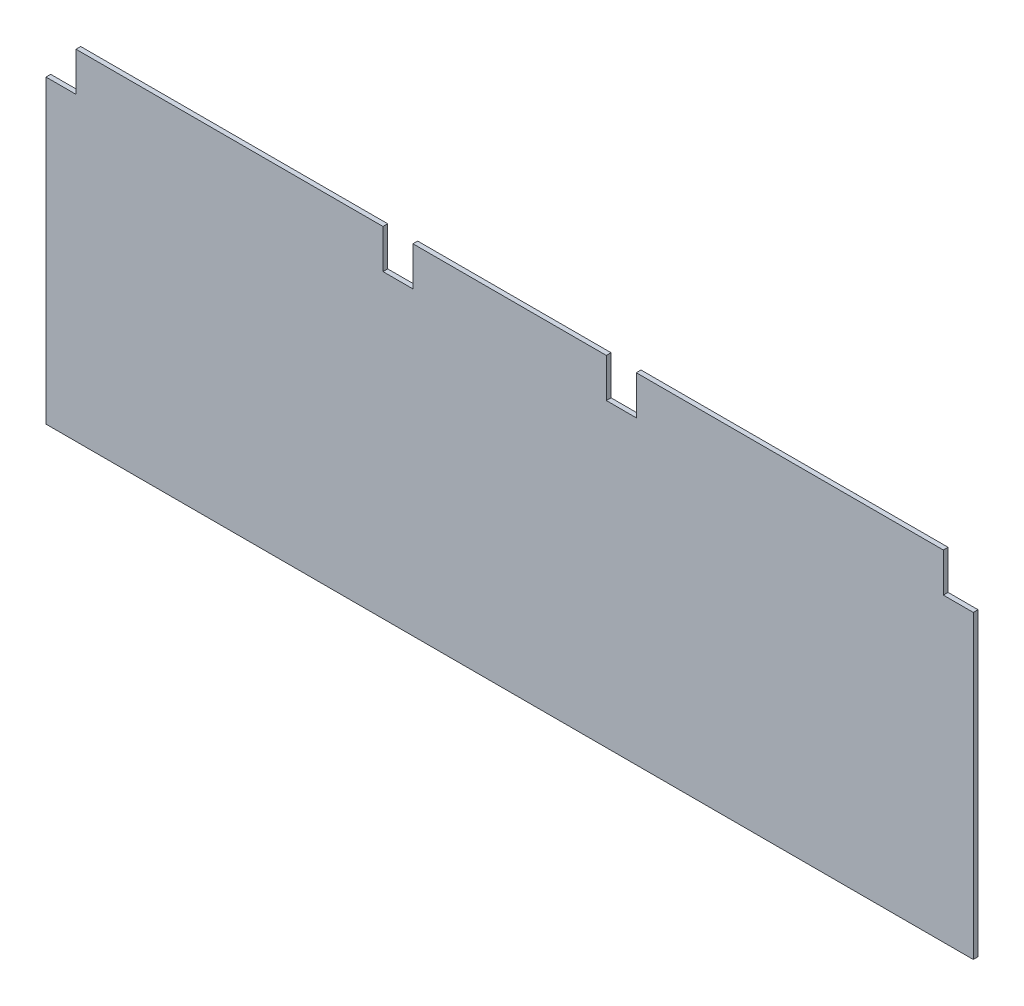
ISO-10303-21;
HEADER;
FILE_DESCRIPTION(('STEP AP214'),'2;1');
FILE_NAME('part.step','',(''),(''),'','','');
FILE_SCHEMA(('AUTOMOTIVE_DESIGN { 1 0 10303 214 1 1 1 1 }'));
ENDSEC;
DATA;
#1=APPLICATION_CONTEXT('core data for automotive mechanical design processes');
#2=APPLICATION_PROTOCOL_DEFINITION('international standard','automotive_design',2000,#1);
#3=PRODUCT_CONTEXT('',#1,'mechanical');
#4=PRODUCT('Part','Part','',(#3));
#5=PRODUCT_RELATED_PRODUCT_CATEGORY('part','',(#4));
#6=PRODUCT_DEFINITION_FORMATION('','',#4);
#7=PRODUCT_DEFINITION_CONTEXT('part definition',#1,'design');
#8=PRODUCT_DEFINITION('design','',#6,#7);
#9=PRODUCT_DEFINITION_SHAPE('','',#8);
#10=(LENGTH_UNIT() NAMED_UNIT(*) SI_UNIT(.MILLI.,.METRE.));
#11=(NAMED_UNIT(*) PLANE_ANGLE_UNIT() SI_UNIT($,.RADIAN.));
#12=(NAMED_UNIT(*) SI_UNIT($,.STERADIAN.) SOLID_ANGLE_UNIT());
#13=UNCERTAINTY_MEASURE_WITH_UNIT(LENGTH_MEASURE(1.E-05),#10,'distance_accuracy_value','');
#14=(GEOMETRIC_REPRESENTATION_CONTEXT(3) GLOBAL_UNCERTAINTY_ASSIGNED_CONTEXT((#13)) GLOBAL_UNIT_ASSIGNED_CONTEXT((#10,
#11,#12)) REPRESENTATION_CONTEXT('',''));
#15=CARTESIAN_POINT('',(0.,0.,0.));
#16=DIRECTION('',(0.,0.,1.));
#17=DIRECTION('',(1.,0.,0.));
#18=AXIS2_PLACEMENT_3D('',#15,#16,#17);
#19=CARTESIAN_POINT('',(-98.2,35.974,1.));
#20=DIRECTION('',(0.,1.,0.));
#21=DIRECTION('',(0.,0.,1.));
#22=AXIS2_PLACEMENT_3D('',#19,#20,#21);
#23=PLANE('',#22);
#24=DIRECTION('',(0.,0.,-1.));
#25=VECTOR('',#24,1.);
#26=CARTESIAN_POINT('',(91.85,35.974,1.));
#27=LINE('',#26,#25);
#28=CARTESIAN_POINT('',(91.85,35.974,1.));
#29=VERTEX_POINT('',#28);
#30=CARTESIAN_POINT('',(91.85,35.974,0.));
#31=VERTEX_POINT('',#30);
#32=EDGE_CURVE('E187',#29,#31,#27,.T.);
#33=ORIENTED_EDGE('',*,*,#32,.T.);
#34=DIRECTION('',(1.,0.,0.));
#35=VECTOR('',#34,1.);
#36=CARTESIAN_POINT('',(-98.2,35.974,0.));
#37=LINE('',#36,#35);
#38=CARTESIAN_POINT('',(26.83,35.974,0.));
#39=VERTEX_POINT('',#38);
#40=EDGE_CURVE('E189',#39,#31,#37,.T.);
#41=ORIENTED_EDGE('',*,*,#40,.F.);
#42=DIRECTION('',(0.,0.,-1.));
#43=VECTOR('',#42,1.);
#44=CARTESIAN_POINT('',(26.83,35.974,1.));
#45=LINE('',#44,#43);
#46=CARTESIAN_POINT('',(26.83,35.974,1.));
#47=VERTEX_POINT('',#46);
#48=EDGE_CURVE('E255',#47,#39,#45,.T.);
#49=ORIENTED_EDGE('',*,*,#48,.F.);
#50=DIRECTION('',(1.,0.,0.));
#51=VECTOR('',#50,1.);
#52=CARTESIAN_POINT('',(-98.2,35.974,1.));
#53=LINE('',#52,#51);
#54=EDGE_CURVE('E171',#47,#29,#53,.T.);
#55=ORIENTED_EDGE('',*,*,#54,.T.);
#56=EDGE_LOOP('',(#33,#41,#49,#55));
#57=FACE_BOUND('',#56,.T.);
#58=ADVANCED_FACE('F33',(#57),#23,.T.);
#59=DIRECTION('',(0.,0.,-1.));
#60=VECTOR('',#59,1.);
#61=CARTESIAN_POINT('',(20.48,35.974,1.));
#62=LINE('',#61,#60);
#63=CARTESIAN_POINT('',(20.48,35.974,1.));
#64=VERTEX_POINT('',#63);
#65=CARTESIAN_POINT('',(20.48,35.974,0.));
#66=VERTEX_POINT('',#65);
#67=EDGE_CURVE('E251',#64,#66,#62,.T.);
#68=ORIENTED_EDGE('',*,*,#67,.T.);
#69=CARTESIAN_POINT('',(-20.48,35.974,0.));
#70=VERTEX_POINT('',#69);
#71=EDGE_CURVE('E192',#70,#66,#37,.T.);
#72=ORIENTED_EDGE('',*,*,#71,.F.);
#73=DIRECTION('',(0.,0.,-1.));
#74=VECTOR('',#73,1.);
#75=CARTESIAN_POINT('',(-20.48,35.974,1.));
#76=LINE('',#75,#74);
#77=CARTESIAN_POINT('',(-20.48,35.974,1.));
#78=VERTEX_POINT('',#77);
#79=EDGE_CURVE('E249',#78,#70,#76,.T.);
#80=ORIENTED_EDGE('',*,*,#79,.F.);
#81=EDGE_CURVE('E174',#78,#64,#53,.T.);
#82=ORIENTED_EDGE('',*,*,#81,.T.);
#83=EDGE_LOOP('',(#68,#72,#80,#82));
#84=FACE_BOUND('',#83,.T.);
#85=ADVANCED_FACE('F247',(#84),#23,.T.);
#86=CARTESIAN_POINT('',(-98.2,-35.974,1.));
#87=DIRECTION('',(0.,1.,0.));
#88=DIRECTION('',(0.,0.,1.));
#89=AXIS2_PLACEMENT_3D('',#86,#87,#88);
#90=PLANE('',#89);
#91=DIRECTION('',(1.,0.,0.));
#92=VECTOR('',#91,1.);
#93=CARTESIAN_POINT('',(-98.2,-35.974,0.));
#94=LINE('',#93,#92);
#95=CARTESIAN_POINT('',(-98.2,-35.974,0.));
#96=VERTEX_POINT('',#95);
#97=CARTESIAN_POINT('',(98.2,-35.974,0.));
#98=VERTEX_POINT('',#97);
#99=EDGE_CURVE('E184',#96,#98,#94,.T.);
#100=ORIENTED_EDGE('',*,*,#99,.T.);
#101=DIRECTION('',(0.,0.,-1.));
#102=VECTOR('',#101,1.);
#103=CARTESIAN_POINT('',(98.2,-35.974,1.));
#104=LINE('',#103,#102);
#105=CARTESIAN_POINT('',(98.2,-35.974,1.));
#106=VERTEX_POINT('',#105);
#107=EDGE_CURVE('E11',#106,#98,#104,.T.);
#108=ORIENTED_EDGE('',*,*,#107,.F.);
#109=DIRECTION('',(1.,0.,0.));
#110=VECTOR('',#109,1.);
#111=CARTESIAN_POINT('',(-98.2,-35.974,1.));
#112=LINE('',#111,#110);
#113=CARTESIAN_POINT('',(-98.2,-35.974,1.));
#114=VERTEX_POINT('',#113);
#115=EDGE_CURVE('E169',#114,#106,#112,.T.);
#116=ORIENTED_EDGE('',*,*,#115,.F.);
#117=DIRECTION('',(0.,0.,-1.));
#118=VECTOR('',#117,1.);
#119=CARTESIAN_POINT('',(-98.2,-35.974,1.));
#120=LINE('',#119,#118);
#121=EDGE_CURVE('E41',#114,#96,#120,.T.);
#122=ORIENTED_EDGE('',*,*,#121,.T.);
#123=EDGE_LOOP('',(#100,#108,#116,#122));
#124=FACE_BOUND('',#123,.T.);
#125=ADVANCED_FACE('F35',(#124),#90,.F.);
#126=CARTESIAN_POINT('',(98.2,-35.974,1.));
#127=DIRECTION('',(-1.,0.,0.));
#128=DIRECTION('',(0.,0.,1.));
#129=AXIS2_PLACEMENT_3D('',#126,#127,#128);
#130=PLANE('',#129);
#131=DIRECTION('',(0.,1.,0.));
#132=VECTOR('',#131,1.);
#133=CARTESIAN_POINT('',(98.2,-35.974,0.));
#134=LINE('',#133,#132);
#135=CARTESIAN_POINT('',(98.2,27.696,0.));
#136=VERTEX_POINT('',#135);
#137=EDGE_CURVE('E164',#98,#136,#134,.T.);
#138=ORIENTED_EDGE('',*,*,#137,.T.);
#139=DIRECTION('',(0.,0.,-1.));
#140=VECTOR('',#139,1.);
#141=CARTESIAN_POINT('',(98.2,27.696,1.));
#142=LINE('',#141,#140);
#143=CARTESIAN_POINT('',(98.2,27.696,1.));
#144=VERTEX_POINT('',#143);
#145=EDGE_CURVE('E149',#144,#136,#142,.T.);
#146=ORIENTED_EDGE('',*,*,#145,.F.);
#147=DIRECTION('',(0.,1.,0.));
#148=VECTOR('',#147,1.);
#149=CARTESIAN_POINT('',(98.2,-35.974,1.));
#150=LINE('',#149,#148);
#151=EDGE_CURVE('E162',#106,#144,#150,.T.);
#152=ORIENTED_EDGE('',*,*,#151,.F.);
#153=ORIENTED_EDGE('',*,*,#107,.T.);
#154=EDGE_LOOP('',(#138,#146,#152,#153));
#155=FACE_BOUND('',#154,.T.);
#156=ADVANCED_FACE('F161',(#155),#130,.F.);
#157=DIRECTION('',(0.,0.,-1.));
#158=VECTOR('',#157,1.);
#159=CARTESIAN_POINT('',(-26.83,35.974,1.));
#160=LINE('',#159,#158);
#161=CARTESIAN_POINT('',(-26.83,35.974,1.));
#162=VERTEX_POINT('',#161);
#163=CARTESIAN_POINT('',(-26.83,35.974,0.));
#164=VERTEX_POINT('',#163);
#165=EDGE_CURVE('E237',#162,#164,#160,.T.);
#166=ORIENTED_EDGE('',*,*,#165,.T.);
#167=CARTESIAN_POINT('',(-91.85,35.974,0.));
#168=VERTEX_POINT('',#167);
#169=EDGE_CURVE('E193',#168,#164,#37,.T.);
#170=ORIENTED_EDGE('',*,*,#169,.F.);
#171=DIRECTION('',(0.,0.,-1.));
#172=VECTOR('',#171,1.);
#173=CARTESIAN_POINT('',(-91.85,35.974,1.));
#174=LINE('',#173,#172);
#175=CARTESIAN_POINT('',(-91.85,35.974,1.));
#176=VERTEX_POINT('',#175);
#177=EDGE_CURVE('E212',#176,#168,#174,.T.);
#178=ORIENTED_EDGE('',*,*,#177,.F.);
#179=EDGE_CURVE('E176',#176,#162,#53,.T.);
#180=ORIENTED_EDGE('',*,*,#179,.T.);
#181=EDGE_LOOP('',(#166,#170,#178,#180));
#182=FACE_BOUND('',#181,.T.);
#183=ADVANCED_FACE('F234',(#182),#23,.T.);
#184=CARTESIAN_POINT('',(-98.2,-35.974,1.));
#185=DIRECTION('',(-1.,0.,0.));
#186=DIRECTION('',(0.,0.,1.));
#187=AXIS2_PLACEMENT_3D('',#184,#185,#186);
#188=PLANE('',#187);
#189=DIRECTION('',(0.,0.,-1.));
#190=VECTOR('',#189,1.);
#191=CARTESIAN_POINT('',(-98.2,27.696,1.));
#192=LINE('',#191,#190);
#193=CARTESIAN_POINT('',(-98.2,27.696,1.));
#194=VERTEX_POINT('',#193);
#195=CARTESIAN_POINT('',(-98.2,27.696,0.));
#196=VERTEX_POINT('',#195);
#197=EDGE_CURVE('E204',#194,#196,#192,.T.);
#198=ORIENTED_EDGE('',*,*,#197,.T.);
#199=DIRECTION('',(0.,1.,0.));
#200=VECTOR('',#199,1.);
#201=CARTESIAN_POINT('',(-98.2,-35.974,0.));
#202=LINE('',#201,#200);
#203=EDGE_CURVE('E177',#96,#196,#202,.T.);
#204=ORIENTED_EDGE('',*,*,#203,.F.);
#205=ORIENTED_EDGE('',*,*,#121,.F.);
#206=DIRECTION('',(0.,1.,0.));
#207=VECTOR('',#206,1.);
#208=CARTESIAN_POINT('',(-98.2,-35.974,1.));
#209=LINE('',#208,#207);
#210=EDGE_CURVE('E181',#114,#194,#209,.T.);
#211=ORIENTED_EDGE('',*,*,#210,.T.);
#212=EDGE_LOOP('',(#198,#204,#205,#211));
#213=FACE_BOUND('',#212,.T.);
#214=ADVANCED_FACE('F203',(#213),#188,.T.);
#215=CARTESIAN_POINT('',(0.,0.,1.));
#216=DIRECTION('',(0.,0.,1.));
#217=DIRECTION('',(1.,0.,0.));
#218=AXIS2_PLACEMENT_3D('',#215,#216,#217);
#219=PLANE('',#218);
#220=DIRECTION('',(0.,1.,0.));
#221=VECTOR('',#220,1.);
#222=CARTESIAN_POINT('',(91.85,35.974,1.));
#223=LINE('',#222,#221);
#224=CARTESIAN_POINT('',(91.85,27.696,1.));
#225=VERTEX_POINT('',#224);
#226=EDGE_CURVE('E156',#225,#29,#223,.T.);
#227=ORIENTED_EDGE('',*,*,#226,.T.);
#228=ORIENTED_EDGE('',*,*,#54,.F.);
#229=DIRECTION('',(0.,-1.,0.));
#230=VECTOR('',#229,1.);
#231=CARTESIAN_POINT('',(26.83,35.974,1.));
#232=LINE('',#231,#230);
#233=CARTESIAN_POINT('',(26.83,27.696,1.));
#234=VERTEX_POINT('',#233);
#235=EDGE_CURVE('E447',#47,#234,#232,.T.);
#236=ORIENTED_EDGE('',*,*,#235,.T.);
#237=DIRECTION('',(-1.,0.,0.));
#238=VECTOR('',#237,1.);
#239=CARTESIAN_POINT('',(26.83,27.696,1.));
#240=LINE('',#239,#238);
#241=CARTESIAN_POINT('',(20.48,27.696,1.));
#242=VERTEX_POINT('',#241);
#243=EDGE_CURVE('E449',#234,#242,#240,.T.);
#244=ORIENTED_EDGE('',*,*,#243,.T.);
#245=DIRECTION('',(0.,1.,0.));
#246=VECTOR('',#245,1.);
#247=CARTESIAN_POINT('',(20.48,35.974,1.));
#248=LINE('',#247,#246);
#249=EDGE_CURVE('E265',#242,#64,#248,.T.);
#250=ORIENTED_EDGE('',*,*,#249,.T.);
#251=ORIENTED_EDGE('',*,*,#81,.F.);
#252=DIRECTION('',(0.,-1.,0.));
#253=VECTOR('',#252,1.);
#254=CARTESIAN_POINT('',(-20.48,35.974,1.));
#255=LINE('',#254,#253);
#256=CARTESIAN_POINT('',(-20.48,27.696,1.));
#257=VERTEX_POINT('',#256);
#258=EDGE_CURVE('E266',#78,#257,#255,.T.);
#259=ORIENTED_EDGE('',*,*,#258,.T.);
#260=DIRECTION('',(-1.,0.,0.));
#261=VECTOR('',#260,1.);
#262=CARTESIAN_POINT('',(-20.48,27.696,1.));
#263=LINE('',#262,#261);
#264=CARTESIAN_POINT('',(-26.83,27.696,1.));
#265=VERTEX_POINT('',#264);
#266=EDGE_CURVE('E269',#257,#265,#263,.T.);
#267=ORIENTED_EDGE('',*,*,#266,.T.);
#268=DIRECTION('',(0.,1.,0.));
#269=VECTOR('',#268,1.);
#270=CARTESIAN_POINT('',(-26.83,35.974,1.));
#271=LINE('',#270,#269);
#272=EDGE_CURVE('E273',#265,#162,#271,.T.);
#273=ORIENTED_EDGE('',*,*,#272,.T.);
#274=ORIENTED_EDGE('',*,*,#179,.F.);
#275=DIRECTION('',(0.,-1.,0.));
#276=VECTOR('',#275,1.);
#277=CARTESIAN_POINT('',(-91.85,35.974,1.));
#278=LINE('',#277,#276);
#279=CARTESIAN_POINT('',(-91.85,27.696,1.));
#280=VERTEX_POINT('',#279);
#281=EDGE_CURVE('E222',#176,#280,#278,.T.);
#282=ORIENTED_EDGE('',*,*,#281,.T.);
#283=DIRECTION('',(-1.,0.,0.));
#284=VECTOR('',#283,1.);
#285=CARTESIAN_POINT('',(-98.2,27.696,1.));
#286=LINE('',#285,#284);
#287=EDGE_CURVE('E217',#280,#194,#286,.T.);
#288=ORIENTED_EDGE('',*,*,#287,.T.);
#289=ORIENTED_EDGE('',*,*,#210,.F.);
#290=ORIENTED_EDGE('',*,*,#115,.T.);
#291=ORIENTED_EDGE('',*,*,#151,.T.);
#292=DIRECTION('',(-1.,0.,0.));
#293=VECTOR('',#292,1.);
#294=CARTESIAN_POINT('',(98.2,27.696,1.));
#295=LINE('',#294,#293);
#296=EDGE_CURVE('E145',#144,#225,#295,.T.);
#297=ORIENTED_EDGE('',*,*,#296,.T.);
#298=EDGE_LOOP('',(#227,#228,#236,#244,#250,#251,#259,#267,#273,#274,#282,#288,#289,#290,#291,#297));
#299=FACE_BOUND('',#298,.T.);
#300=ADVANCED_FACE('F166',(#299),#219,.T.);
#301=CARTESIAN_POINT('',(0.,0.,0.));
#302=DIRECTION('',(0.,0.,1.));
#303=DIRECTION('',(1.,0.,0.));
#304=AXIS2_PLACEMENT_3D('',#301,#302,#303);
#305=PLANE('',#304);
#306=ORIENTED_EDGE('',*,*,#40,.T.);
#307=DIRECTION('',(0.,1.,0.));
#308=VECTOR('',#307,1.);
#309=CARTESIAN_POINT('',(91.85,35.974,0.));
#310=LINE('',#309,#308);
#311=CARTESIAN_POINT('',(91.85,27.696,0.));
#312=VERTEX_POINT('',#311);
#313=EDGE_CURVE('E157',#312,#31,#310,.T.);
#314=ORIENTED_EDGE('',*,*,#313,.F.);
#315=DIRECTION('',(-1.,0.,0.));
#316=VECTOR('',#315,1.);
#317=CARTESIAN_POINT('',(98.2,27.696,0.));
#318=LINE('',#317,#316);
#319=EDGE_CURVE('E258',#136,#312,#318,.T.);
#320=ORIENTED_EDGE('',*,*,#319,.F.);
#321=ORIENTED_EDGE('',*,*,#137,.F.);
#322=ORIENTED_EDGE('',*,*,#99,.F.);
#323=ORIENTED_EDGE('',*,*,#203,.T.);
#324=DIRECTION('',(-1.,0.,0.));
#325=VECTOR('',#324,1.);
#326=CARTESIAN_POINT('',(-98.2,27.696,0.));
#327=LINE('',#326,#325);
#328=CARTESIAN_POINT('',(-91.85,27.696,0.));
#329=VERTEX_POINT('',#328);
#330=EDGE_CURVE('E215',#329,#196,#327,.T.);
#331=ORIENTED_EDGE('',*,*,#330,.F.);
#332=DIRECTION('',(0.,-1.,0.));
#333=VECTOR('',#332,1.);
#334=CARTESIAN_POINT('',(-91.85,35.974,0.));
#335=LINE('',#334,#333);
#336=EDGE_CURVE('E227',#168,#329,#335,.T.);
#337=ORIENTED_EDGE('',*,*,#336,.F.);
#338=ORIENTED_EDGE('',*,*,#169,.T.);
#339=DIRECTION('',(0.,1.,0.));
#340=VECTOR('',#339,1.);
#341=CARTESIAN_POINT('',(-26.83,35.974,0.));
#342=LINE('',#341,#340);
#343=CARTESIAN_POINT('',(-26.83,27.696,0.));
#344=VERTEX_POINT('',#343);
#345=EDGE_CURVE('E270',#344,#164,#342,.T.);
#346=ORIENTED_EDGE('',*,*,#345,.F.);
#347=DIRECTION('',(-1.,0.,0.));
#348=VECTOR('',#347,1.);
#349=CARTESIAN_POINT('',(-20.48,27.696,0.));
#350=LINE('',#349,#348);
#351=CARTESIAN_POINT('',(-20.48,27.696,0.));
#352=VERTEX_POINT('',#351);
#353=EDGE_CURVE('E210',#352,#344,#350,.T.);
#354=ORIENTED_EDGE('',*,*,#353,.F.);
#355=DIRECTION('',(0.,-1.,0.));
#356=VECTOR('',#355,1.);
#357=CARTESIAN_POINT('',(-20.48,35.974,0.));
#358=LINE('',#357,#356);
#359=EDGE_CURVE('E56',#70,#352,#358,.T.);
#360=ORIENTED_EDGE('',*,*,#359,.F.);
#361=ORIENTED_EDGE('',*,*,#71,.T.);
#362=DIRECTION('',(0.,1.,0.));
#363=VECTOR('',#362,1.);
#364=CARTESIAN_POINT('',(20.48,35.974,0.));
#365=LINE('',#364,#363);
#366=CARTESIAN_POINT('',(20.48,27.696,0.));
#367=VERTEX_POINT('',#366);
#368=EDGE_CURVE('E242',#367,#66,#365,.T.);
#369=ORIENTED_EDGE('',*,*,#368,.F.);
#370=DIRECTION('',(-1.,0.,0.));
#371=VECTOR('',#370,1.);
#372=CARTESIAN_POINT('',(26.83,27.696,0.));
#373=LINE('',#372,#371);
#374=CARTESIAN_POINT('',(26.83,27.696,0.));
#375=VERTEX_POINT('',#374);
#376=EDGE_CURVE('E442',#375,#367,#373,.T.);
#377=ORIENTED_EDGE('',*,*,#376,.F.);
#378=DIRECTION('',(0.,-1.,0.));
#379=VECTOR('',#378,1.);
#380=CARTESIAN_POINT('',(26.83,35.974,0.));
#381=LINE('',#380,#379);
#382=EDGE_CURVE('E48',#39,#375,#381,.T.);
#383=ORIENTED_EDGE('',*,*,#382,.F.);
#384=EDGE_LOOP('',(#306,#314,#320,#321,#322,#323,#331,#337,#338,#346,#354,#360,#361,#369,#377,#383));
#385=FACE_BOUND('',#384,.T.);
#386=ADVANCED_FACE('F200',(#385),#305,.F.);
#387=CARTESIAN_POINT('',(-98.2,27.696,1.));
#388=DIRECTION('',(0.,-1.,0.));
#389=DIRECTION('',(0.,0.,-1.));
#390=AXIS2_PLACEMENT_3D('',#387,#388,#389);
#391=PLANE('',#390);
#392=ORIENTED_EDGE('',*,*,#330,.T.);
#393=ORIENTED_EDGE('',*,*,#197,.F.);
#394=ORIENTED_EDGE('',*,*,#287,.F.);
#395=DIRECTION('',(0.,0.,-1.));
#396=VECTOR('',#395,1.);
#397=CARTESIAN_POINT('',(-91.85,27.696,1.));
#398=LINE('',#397,#396);
#399=EDGE_CURVE('E208',#280,#329,#398,.T.);
#400=ORIENTED_EDGE('',*,*,#399,.T.);
#401=EDGE_LOOP('',(#392,#393,#394,#400));
#402=FACE_BOUND('',#401,.T.);
#403=ADVANCED_FACE('F228',(#402),#391,.F.);
#404=CARTESIAN_POINT('',(-91.85,35.974,1.));
#405=DIRECTION('',(1.,0.,0.));
#406=DIRECTION('',(0.,0.,-1.));
#407=AXIS2_PLACEMENT_3D('',#404,#405,#406);
#408=PLANE('',#407);
#409=ORIENTED_EDGE('',*,*,#336,.T.);
#410=ORIENTED_EDGE('',*,*,#399,.F.);
#411=ORIENTED_EDGE('',*,*,#281,.F.);
#412=ORIENTED_EDGE('',*,*,#177,.T.);
#413=EDGE_LOOP('',(#409,#410,#411,#412));
#414=FACE_BOUND('',#413,.T.);
#415=ADVANCED_FACE('F291',(#414),#408,.F.);
#416=CARTESIAN_POINT('',(-20.48,35.974,1.));
#417=DIRECTION('',(1.,0.,0.));
#418=DIRECTION('',(0.,1.,0.));
#419=AXIS2_PLACEMENT_3D('',#416,#417,#418);
#420=PLANE('',#419);
#421=ORIENTED_EDGE('',*,*,#359,.T.);
#422=DIRECTION('',(0.,0.,-1.));
#423=VECTOR('',#422,1.);
#424=CARTESIAN_POINT('',(-20.48,27.696,1.));
#425=LINE('',#424,#423);
#426=EDGE_CURVE('E275',#257,#352,#425,.T.);
#427=ORIENTED_EDGE('',*,*,#426,.F.);
#428=ORIENTED_EDGE('',*,*,#258,.F.);
#429=ORIENTED_EDGE('',*,*,#79,.T.);
#430=EDGE_LOOP('',(#421,#427,#428,#429));
#431=FACE_BOUND('',#430,.T.);
#432=ADVANCED_FACE('F289',(#431),#420,.F.);
#433=CARTESIAN_POINT('',(-26.83,35.974,1.));
#434=DIRECTION('',(-1.,0.,0.));
#435=DIRECTION('',(0.,-1.,0.));
#436=AXIS2_PLACEMENT_3D('',#433,#434,#435);
#437=PLANE('',#436);
#438=ORIENTED_EDGE('',*,*,#345,.T.);
#439=ORIENTED_EDGE('',*,*,#165,.F.);
#440=ORIENTED_EDGE('',*,*,#272,.F.);
#441=DIRECTION('',(0.,0.,-1.));
#442=VECTOR('',#441,1.);
#443=CARTESIAN_POINT('',(-26.83,27.696,1.));
#444=LINE('',#443,#442);
#445=EDGE_CURVE('E282',#265,#344,#444,.T.);
#446=ORIENTED_EDGE('',*,*,#445,.T.);
#447=EDGE_LOOP('',(#438,#439,#440,#446));
#448=FACE_BOUND('',#447,.T.);
#449=ADVANCED_FACE('F287',(#448),#437,.F.);
#450=CARTESIAN_POINT('',(-20.48,27.696,1.));
#451=DIRECTION('',(0.,-1.,0.));
#452=DIRECTION('',(0.,0.,-1.));
#453=AXIS2_PLACEMENT_3D('',#450,#451,#452);
#454=PLANE('',#453);
#455=ORIENTED_EDGE('',*,*,#353,.T.);
#456=ORIENTED_EDGE('',*,*,#445,.F.);
#457=ORIENTED_EDGE('',*,*,#266,.F.);
#458=ORIENTED_EDGE('',*,*,#426,.T.);
#459=EDGE_LOOP('',(#455,#456,#457,#458));
#460=FACE_BOUND('',#459,.T.);
#461=ADVANCED_FACE('F285',(#460),#454,.F.);
#462=CARTESIAN_POINT('',(26.83,35.974,1.));
#463=DIRECTION('',(1.,0.,0.));
#464=DIRECTION('',(0.,0.,-1.));
#465=AXIS2_PLACEMENT_3D('',#462,#463,#464);
#466=PLANE('',#465);
#467=ORIENTED_EDGE('',*,*,#382,.T.);
#468=DIRECTION('',(0.,0.,-1.));
#469=VECTOR('',#468,1.);
#470=CARTESIAN_POINT('',(26.83,27.696,1.));
#471=LINE('',#470,#469);
#472=EDGE_CURVE('E260',#234,#375,#471,.T.);
#473=ORIENTED_EDGE('',*,*,#472,.F.);
#474=ORIENTED_EDGE('',*,*,#235,.F.);
#475=ORIENTED_EDGE('',*,*,#48,.T.);
#476=EDGE_LOOP('',(#467,#473,#474,#475));
#477=FACE_BOUND('',#476,.T.);
#478=ADVANCED_FACE('F387',(#477),#466,.F.);
#479=CARTESIAN_POINT('',(20.48,35.974,1.));
#480=DIRECTION('',(-1.,0.,0.));
#481=DIRECTION('',(0.,-1.,0.));
#482=AXIS2_PLACEMENT_3D('',#479,#480,#481);
#483=PLANE('',#482);
#484=ORIENTED_EDGE('',*,*,#368,.T.);
#485=ORIENTED_EDGE('',*,*,#67,.F.);
#486=ORIENTED_EDGE('',*,*,#249,.F.);
#487=DIRECTION('',(0.,0.,-1.));
#488=VECTOR('',#487,1.);
#489=CARTESIAN_POINT('',(20.48,27.696,1.));
#490=LINE('',#489,#488);
#491=EDGE_CURVE('E256',#242,#367,#490,.T.);
#492=ORIENTED_EDGE('',*,*,#491,.T.);
#493=EDGE_LOOP('',(#484,#485,#486,#492));
#494=FACE_BOUND('',#493,.T.);
#495=ADVANCED_FACE('F395',(#494),#483,.F.);
#496=CARTESIAN_POINT('',(26.83,27.696,1.));
#497=DIRECTION('',(0.,-1.,0.));
#498=DIRECTION('',(0.,0.,-1.));
#499=AXIS2_PLACEMENT_3D('',#496,#497,#498);
#500=PLANE('',#499);
#501=ORIENTED_EDGE('',*,*,#376,.T.);
#502=ORIENTED_EDGE('',*,*,#491,.F.);
#503=ORIENTED_EDGE('',*,*,#243,.F.);
#504=ORIENTED_EDGE('',*,*,#472,.T.);
#505=EDGE_LOOP('',(#501,#502,#503,#504));
#506=FACE_BOUND('',#505,.T.);
#507=ADVANCED_FACE('F404',(#506),#500,.F.);
#508=CARTESIAN_POINT('',(91.85,35.974,1.));
#509=DIRECTION('',(-1.,0.,0.));
#510=DIRECTION('',(0.,0.,1.));
#511=AXIS2_PLACEMENT_3D('',#508,#509,#510);
#512=PLANE('',#511);
#513=ORIENTED_EDGE('',*,*,#313,.T.);
#514=ORIENTED_EDGE('',*,*,#32,.F.);
#515=ORIENTED_EDGE('',*,*,#226,.F.);
#516=DIRECTION('',(0.,0.,-1.));
#517=VECTOR('',#516,1.);
#518=CARTESIAN_POINT('',(91.85,27.696,1.));
#519=LINE('',#518,#517);
#520=EDGE_CURVE('E151',#225,#312,#519,.T.);
#521=ORIENTED_EDGE('',*,*,#520,.T.);
#522=EDGE_LOOP('',(#513,#514,#515,#521));
#523=FACE_BOUND('',#522,.T.);
#524=ADVANCED_FACE('F413',(#523),#512,.F.);
#525=CARTESIAN_POINT('',(98.2,27.696,1.));
#526=DIRECTION('',(0.,-1.,0.));
#527=DIRECTION('',(0.,0.,-1.));
#528=AXIS2_PLACEMENT_3D('',#525,#526,#527);
#529=PLANE('',#528);
#530=ORIENTED_EDGE('',*,*,#319,.T.);
#531=ORIENTED_EDGE('',*,*,#520,.F.);
#532=ORIENTED_EDGE('',*,*,#296,.F.);
#533=ORIENTED_EDGE('',*,*,#145,.T.);
#534=EDGE_LOOP('',(#530,#531,#532,#533));
#535=FACE_BOUND('',#534,.T.);
#536=ADVANCED_FACE('F148',(#535),#529,.F.);
#537=CLOSED_SHELL('',(#58,#85,#125,#156,#183,#214,#300,#386,#403,#415,#432,#449,#461,#478,#495,
#507,#524,#536));
#538=MANIFOLD_SOLID_BREP('B2',#537);
#539=ADVANCED_BREP_SHAPE_REPRESENTATION('',(#18,#538),#14);
#540=SHAPE_DEFINITION_REPRESENTATION(#9,#539);
ENDSEC;
END-ISO-10303-21;
